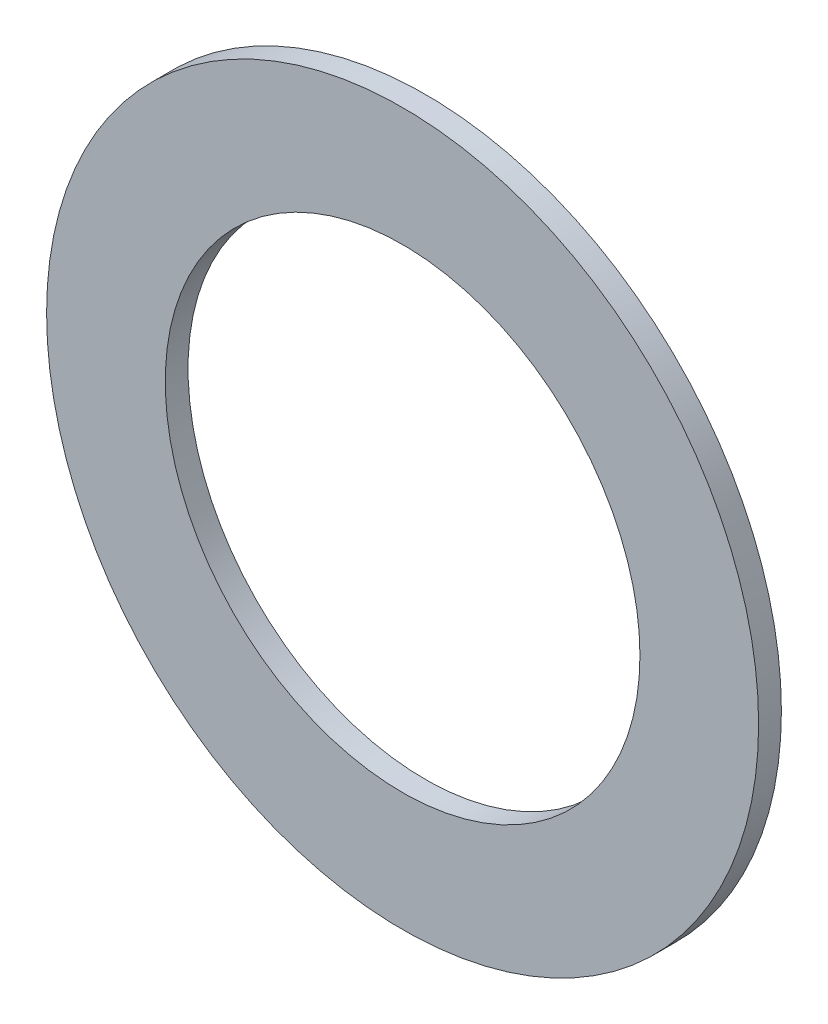
ISO-10303-21;
HEADER;
FILE_DESCRIPTION(('STEP AP214'),'2;1');
FILE_NAME('part.step','',(''),(''),'','','');
FILE_SCHEMA(('AUTOMOTIVE_DESIGN { 1 0 10303 214 1 1 1 1 }'));
ENDSEC;
DATA;
#1=APPLICATION_CONTEXT('core data for automotive mechanical design processes');
#2=APPLICATION_PROTOCOL_DEFINITION('international standard','automotive_design',2000,#1);
#3=PRODUCT_CONTEXT('',#1,'mechanical');
#4=PRODUCT('Part','Part','',(#3));
#5=PRODUCT_RELATED_PRODUCT_CATEGORY('part','',(#4));
#6=PRODUCT_DEFINITION_FORMATION('','',#4);
#7=PRODUCT_DEFINITION_CONTEXT('part definition',#1,'design');
#8=PRODUCT_DEFINITION('design','',#6,#7);
#9=PRODUCT_DEFINITION_SHAPE('','',#8);
#10=(LENGTH_UNIT() NAMED_UNIT(*) SI_UNIT(.MILLI.,.METRE.));
#11=(NAMED_UNIT(*) PLANE_ANGLE_UNIT() SI_UNIT($,.RADIAN.));
#12=(NAMED_UNIT(*) SI_UNIT($,.STERADIAN.) SOLID_ANGLE_UNIT());
#13=UNCERTAINTY_MEASURE_WITH_UNIT(LENGTH_MEASURE(1.E-05),#10,'distance_accuracy_value','');
#14=(GEOMETRIC_REPRESENTATION_CONTEXT(3) GLOBAL_UNCERTAINTY_ASSIGNED_CONTEXT((#13)) GLOBAL_UNIT_ASSIGNED_CONTEXT((#10,
#11,#12)) REPRESENTATION_CONTEXT('',''));
#15=CARTESIAN_POINT('',(0.,0.,0.));
#16=DIRECTION('',(0.,0.,1.));
#17=DIRECTION('',(1.,0.,0.));
#18=AXIS2_PLACEMENT_3D('',#15,#16,#17);
#19=CARTESIAN_POINT('',(0.,0.,0.3048));
#20=DIRECTION('',(0.,0.,1.));
#21=DIRECTION('',(1.,0.,0.));
#22=AXIS2_PLACEMENT_3D('',#19,#20,#21);
#23=PLANE('',#22);
#24=CARTESIAN_POINT('',(0.,0.,0.3048));
#25=DIRECTION('',(0.,0.,1.));
#26=DIRECTION('',(1.,0.,0.));
#27=AXIS2_PLACEMENT_3D('',#24,#25,#26);
#28=CIRCLE('',#27,4.7625);
#29=CARTESIAN_POINT('',(4.7625,0.,0.3048));
#30=VERTEX_POINT('',#29);
#31=EDGE_CURVE('E10',#30,#30,#28,.T.);
#32=ORIENTED_EDGE('',*,*,#31,.T.);
#33=EDGE_LOOP('',(#32));
#34=FACE_BOUND('',#33,.T.);
#35=CARTESIAN_POINT('',(0.,0.,0.3048));
#36=DIRECTION('',(0.,0.,1.));
#37=DIRECTION('',(1.,0.,0.));
#38=AXIS2_PLACEMENT_3D('',#35,#36,#37);
#39=CIRCLE('',#38,3.175);
#40=CARTESIAN_POINT('',(3.175,0.,0.3048));
#41=VERTEX_POINT('',#40);
#42=EDGE_CURVE('E40',#41,#41,#39,.T.);
#43=ORIENTED_EDGE('',*,*,#42,.F.);
#44=EDGE_LOOP('',(#43));
#45=FACE_BOUND('',#44,.T.);
#46=ADVANCED_FACE('F29',(#34,#45),#23,.T.);
#47=CARTESIAN_POINT('',(0.,0.,0.));
#48=DIRECTION('',(0.,0.,1.));
#49=DIRECTION('',(1.,0.,0.));
#50=AXIS2_PLACEMENT_3D('',#47,#48,#49);
#51=PLANE('',#50);
#52=CARTESIAN_POINT('',(0.,0.,0.));
#53=DIRECTION('',(0.,0.,1.));
#54=DIRECTION('',(1.,0.,0.));
#55=AXIS2_PLACEMENT_3D('',#52,#53,#54);
#56=CIRCLE('',#55,4.7625);
#57=CARTESIAN_POINT('',(4.7625,0.,0.));
#58=VERTEX_POINT('',#57);
#59=EDGE_CURVE('E33',#58,#58,#56,.T.);
#60=ORIENTED_EDGE('',*,*,#59,.F.);
#61=EDGE_LOOP('',(#60));
#62=FACE_BOUND('',#61,.T.);
#63=CARTESIAN_POINT('',(0.,0.,0.));
#64=DIRECTION('',(0.,0.,1.));
#65=DIRECTION('',(1.,0.,0.));
#66=AXIS2_PLACEMENT_3D('',#63,#64,#65);
#67=CIRCLE('',#66,3.175);
#68=CARTESIAN_POINT('',(3.175,0.,0.));
#69=VERTEX_POINT('',#68);
#70=EDGE_CURVE('E42',#69,#69,#67,.T.);
#71=ORIENTED_EDGE('',*,*,#70,.T.);
#72=EDGE_LOOP('',(#71));
#73=FACE_BOUND('',#72,.T.);
#74=ADVANCED_FACE('F52',(#62,#73),#51,.F.);
#75=CARTESIAN_POINT('',(0.,0.,0.3048));
#76=DIRECTION('',(0.,0.,-1.));
#77=DIRECTION('',(-1.,0.,0.));
#78=AXIS2_PLACEMENT_3D('',#75,#76,#77);
#79=CYLINDRICAL_SURFACE('',#78,4.7625);
#80=ORIENTED_EDGE('',*,*,#31,.F.);
#81=EDGE_LOOP('',(#80));
#82=FACE_BOUND('',#81,.T.);
#83=ORIENTED_EDGE('',*,*,#59,.T.);
#84=EDGE_LOOP('',(#83));
#85=FACE_BOUND('',#84,.T.);
#86=ADVANCED_FACE('F31',(#82,#85),#79,.T.);
#87=CARTESIAN_POINT('',(0.,0.,0.3048));
#88=DIRECTION('',(0.,0.,-1.));
#89=DIRECTION('',(-1.,0.,0.));
#90=AXIS2_PLACEMENT_3D('',#87,#88,#89);
#91=CYLINDRICAL_SURFACE('',#90,3.175);
#92=ORIENTED_EDGE('',*,*,#42,.T.);
#93=EDGE_LOOP('',(#92));
#94=FACE_BOUND('',#93,.T.);
#95=ORIENTED_EDGE('',*,*,#70,.F.);
#96=EDGE_LOOP('',(#95));
#97=FACE_BOUND('',#96,.T.);
#98=ADVANCED_FACE('F48',(#94,#97),#91,.F.);
#99=CLOSED_SHELL('',(#46,#74,#86,#98));
#100=MANIFOLD_SOLID_BREP('B2',#99);
#101=ADVANCED_BREP_SHAPE_REPRESENTATION('',(#18,#100),#14);
#102=SHAPE_DEFINITION_REPRESENTATION(#9,#101);
ENDSEC;
END-ISO-10303-21;
